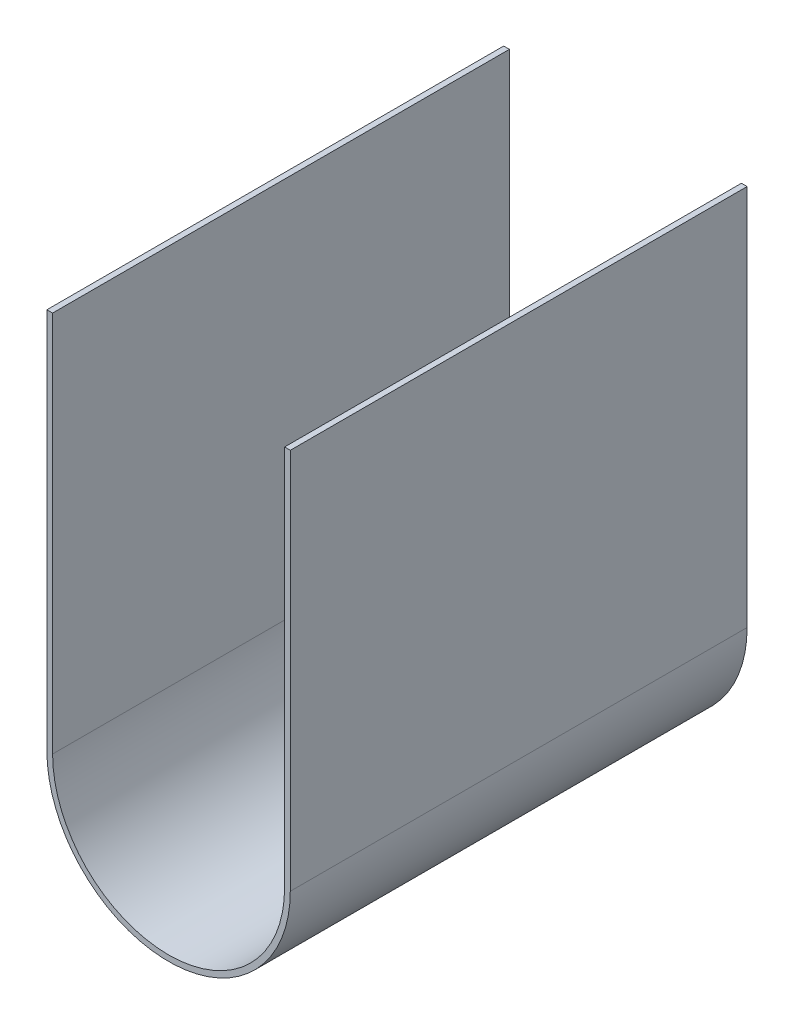
ISO-10303-21;
HEADER;
FILE_DESCRIPTION(('STEP AP214'),'2;1');
FILE_NAME('part.step','',(''),(''),'','','');
FILE_SCHEMA(('AUTOMOTIVE_DESIGN { 1 0 10303 214 1 1 1 1 }'));
ENDSEC;
DATA;
#1=APPLICATION_CONTEXT('core data for automotive mechanical design processes');
#2=APPLICATION_PROTOCOL_DEFINITION('international standard','automotive_design',2000,#1);
#3=PRODUCT_CONTEXT('',#1,'mechanical');
#4=PRODUCT('Part','Part','',(#3));
#5=PRODUCT_RELATED_PRODUCT_CATEGORY('part','',(#4));
#6=PRODUCT_DEFINITION_FORMATION('','',#4);
#7=PRODUCT_DEFINITION_CONTEXT('part definition',#1,'design');
#8=PRODUCT_DEFINITION('design','',#6,#7);
#9=PRODUCT_DEFINITION_SHAPE('','',#8);
#10=(LENGTH_UNIT() NAMED_UNIT(*) SI_UNIT(.MILLI.,.METRE.));
#11=(NAMED_UNIT(*) PLANE_ANGLE_UNIT() SI_UNIT($,.RADIAN.));
#12=(NAMED_UNIT(*) SI_UNIT($,.STERADIAN.) SOLID_ANGLE_UNIT());
#13=UNCERTAINTY_MEASURE_WITH_UNIT(LENGTH_MEASURE(1.E-05),#10,'distance_accuracy_value','');
#14=(GEOMETRIC_REPRESENTATION_CONTEXT(3) GLOBAL_UNCERTAINTY_ASSIGNED_CONTEXT((#13)) GLOBAL_UNIT_ASSIGNED_CONTEXT((#10,
#11,#12)) REPRESENTATION_CONTEXT('',''));
#15=CARTESIAN_POINT('',(0.,0.,0.));
#16=DIRECTION('',(0.,0.,1.));
#17=DIRECTION('',(1.,0.,0.));
#18=AXIS2_PLACEMENT_3D('',#15,#16,#17);
#19=CARTESIAN_POINT('',(34.1,0.,128.));
#20=DIRECTION('',(1.,0.,0.));
#21=DIRECTION('',(0.,1.,0.));
#22=AXIS2_PLACEMENT_3D('',#19,#20,#21);
#23=PLANE('',#22);
#24=DIRECTION('',(0.,0.,-1.));
#25=VECTOR('',#24,1.);
#26=CARTESIAN_POINT('',(34.1,12.,128.));
#27=LINE('',#26,#25);
#28=CARTESIAN_POINT('',(34.1,12.,128.));
#29=VERTEX_POINT('',#28);
#30=CARTESIAN_POINT('',(34.1,12.,0.));
#31=VERTEX_POINT('',#30);
#32=EDGE_CURVE('E64',#29,#31,#27,.T.);
#33=ORIENTED_EDGE('',*,*,#32,.F.);
#34=DIRECTION('',(0.,-1.,0.));
#35=VECTOR('',#34,1.);
#36=CARTESIAN_POINT('',(34.1,0.,128.));
#37=LINE('',#36,#35);
#38=CARTESIAN_POINT('',(34.1,-95.,128.));
#39=VERTEX_POINT('',#38);
#40=EDGE_CURVE('E132',#29,#39,#37,.T.);
#41=ORIENTED_EDGE('',*,*,#40,.T.);
#42=DIRECTION('',(0.,0.,-1.));
#43=VECTOR('',#42,1.);
#44=CARTESIAN_POINT('',(34.1,-95.,128.));
#45=LINE('',#44,#43);
#46=CARTESIAN_POINT('',(34.1,-95.,0.));
#47=VERTEX_POINT('',#46);
#48=EDGE_CURVE('E139',#39,#47,#45,.T.);
#49=ORIENTED_EDGE('',*,*,#48,.T.);
#50=DIRECTION('',(0.,-1.,0.));
#51=VECTOR('',#50,1.);
#52=CARTESIAN_POINT('',(34.1,0.,0.));
#53=LINE('',#52,#51);
#54=EDGE_CURVE('E140',#31,#47,#53,.T.);
#55=ORIENTED_EDGE('',*,*,#54,.F.);
#56=EDGE_LOOP('',(#33,#41,#49,#55));
#57=FACE_BOUND('',#56,.T.);
#58=ADVANCED_FACE('F43',(#57),#23,.T.);
#59=CARTESIAN_POINT('',(32.5,0.,128.));
#60=DIRECTION('',(1.,0.,0.));
#61=DIRECTION('',(0.,0.,-1.));
#62=AXIS2_PLACEMENT_3D('',#59,#60,#61);
#63=PLANE('',#62);
#64=DIRECTION('',(0.,-1.,0.));
#65=VECTOR('',#64,1.);
#66=CARTESIAN_POINT('',(32.5,0.,128.));
#67=LINE('',#66,#65);
#68=CARTESIAN_POINT('',(32.5,12.,128.));
#69=VERTEX_POINT('',#68);
#70=CARTESIAN_POINT('',(32.5,-95.,128.));
#71=VERTEX_POINT('',#70);
#72=EDGE_CURVE('E137',#69,#71,#67,.T.);
#73=ORIENTED_EDGE('',*,*,#72,.F.);
#74=DIRECTION('',(0.,0.,-1.));
#75=VECTOR('',#74,1.);
#76=CARTESIAN_POINT('',(32.5,12.,128.));
#77=LINE('',#76,#75);
#78=CARTESIAN_POINT('',(32.5,12.,0.));
#79=VERTEX_POINT('',#78);
#80=EDGE_CURVE('E143',#69,#79,#77,.T.);
#81=ORIENTED_EDGE('',*,*,#80,.T.);
#82=DIRECTION('',(0.,-1.,0.));
#83=VECTOR('',#82,1.);
#84=CARTESIAN_POINT('',(32.5,0.,0.));
#85=LINE('',#84,#83);
#86=CARTESIAN_POINT('',(32.5,-95.,0.));
#87=VERTEX_POINT('',#86);
#88=EDGE_CURVE('E153',#79,#87,#85,.T.);
#89=ORIENTED_EDGE('',*,*,#88,.T.);
#90=DIRECTION('',(0.,0.,-1.));
#91=VECTOR('',#90,1.);
#92=CARTESIAN_POINT('',(32.5,-95.,128.));
#93=LINE('',#92,#91);
#94=EDGE_CURVE('E50',#71,#87,#93,.T.);
#95=ORIENTED_EDGE('',*,*,#94,.F.);
#96=EDGE_LOOP('',(#73,#81,#89,#95));
#97=FACE_BOUND('',#96,.T.);
#98=ADVANCED_FACE('F176',(#97),#63,.F.);
#99=CARTESIAN_POINT('',(0.,-95.,128.));
#100=DIRECTION('',(0.,0.,-1.));
#101=DIRECTION('',(-1.,0.,0.));
#102=AXIS2_PLACEMENT_3D('',#99,#100,#101);
#103=CYLINDRICAL_SURFACE('',#102,32.5);
#104=CARTESIAN_POINT('',(0.,-95.,0.));
#105=DIRECTION('',(0.,0.,-1.));
#106=DIRECTION('',(-1.,0.,0.));
#107=AXIS2_PLACEMENT_3D('',#104,#105,#106);
#108=CIRCLE('',#107,32.5);
#109=CARTESIAN_POINT('',(-32.5,-95.,0.));
#110=VERTEX_POINT('',#109);
#111=EDGE_CURVE('E151',#87,#110,#108,.T.);
#112=ORIENTED_EDGE('',*,*,#111,.T.);
#113=DIRECTION('',(0.,0.,-1.));
#114=VECTOR('',#113,1.);
#115=CARTESIAN_POINT('',(-32.5,-95.,128.));
#116=LINE('',#115,#114);
#117=CARTESIAN_POINT('',(-32.5,-95.,128.));
#118=VERTEX_POINT('',#117);
#119=EDGE_CURVE('E157',#118,#110,#116,.T.);
#120=ORIENTED_EDGE('',*,*,#119,.F.);
#121=CARTESIAN_POINT('',(0.,-95.,128.));
#122=DIRECTION('',(0.,0.,-1.));
#123=DIRECTION('',(-1.,0.,0.));
#124=AXIS2_PLACEMENT_3D('',#121,#122,#123);
#125=CIRCLE('',#124,32.5);
#126=EDGE_CURVE('E130',#71,#118,#125,.T.);
#127=ORIENTED_EDGE('',*,*,#126,.F.);
#128=ORIENTED_EDGE('',*,*,#94,.T.);
#129=EDGE_LOOP('',(#112,#120,#127,#128));
#130=FACE_BOUND('',#129,.T.);
#131=ADVANCED_FACE('F188',(#130),#103,.F.);
#132=CARTESIAN_POINT('',(-32.5,0.,128.));
#133=DIRECTION('',(-1.,0.,0.));
#134=DIRECTION('',(0.,0.,1.));
#135=AXIS2_PLACEMENT_3D('',#132,#133,#134);
#136=PLANE('',#135);
#137=DIRECTION('',(0.,1.,0.));
#138=VECTOR('',#137,1.);
#139=CARTESIAN_POINT('',(-32.5,0.,0.));
#140=LINE('',#139,#138);
#141=CARTESIAN_POINT('',(-32.5,12.,0.));
#142=VERTEX_POINT('',#141);
#143=EDGE_CURVE('E148',#110,#142,#140,.T.);
#144=ORIENTED_EDGE('',*,*,#143,.T.);
#145=DIRECTION('',(0.,0.,1.));
#146=VECTOR('',#145,1.);
#147=CARTESIAN_POINT('',(-32.5,12.,128.));
#148=LINE('',#147,#146);
#149=CARTESIAN_POINT('',(-32.5,12.,128.));
#150=VERTEX_POINT('',#149);
#151=EDGE_CURVE('E57',#142,#150,#148,.T.);
#152=ORIENTED_EDGE('',*,*,#151,.T.);
#153=DIRECTION('',(0.,1.,0.));
#154=VECTOR('',#153,1.);
#155=CARTESIAN_POINT('',(-32.5,0.,128.));
#156=LINE('',#155,#154);
#157=EDGE_CURVE('E124',#118,#150,#156,.T.);
#158=ORIENTED_EDGE('',*,*,#157,.F.);
#159=ORIENTED_EDGE('',*,*,#119,.T.);
#160=EDGE_LOOP('',(#144,#152,#158,#159));
#161=FACE_BOUND('',#160,.T.);
#162=ADVANCED_FACE('F184',(#161),#136,.F.);
#163=CARTESIAN_POINT('',(-34.1,0.,128.));
#164=DIRECTION('',(-1.,0.,0.));
#165=DIRECTION('',(0.,0.,1.));
#166=AXIS2_PLACEMENT_3D('',#163,#164,#165);
#167=PLANE('',#166);
#168=DIRECTION('',(0.,0.,-1.));
#169=VECTOR('',#168,1.);
#170=CARTESIAN_POINT('',(-34.1,12.,128.));
#171=LINE('',#170,#169);
#172=CARTESIAN_POINT('',(-34.1,12.,128.));
#173=VERTEX_POINT('',#172);
#174=CARTESIAN_POINT('',(-34.1,12.,0.));
#175=VERTEX_POINT('',#174);
#176=EDGE_CURVE('E104',#173,#175,#171,.T.);
#177=ORIENTED_EDGE('',*,*,#176,.T.);
#178=DIRECTION('',(0.,1.,0.));
#179=VECTOR('',#178,1.);
#180=CARTESIAN_POINT('',(-34.1,0.,0.));
#181=LINE('',#180,#179);
#182=CARTESIAN_POINT('',(-34.1,-95.,0.));
#183=VERTEX_POINT('',#182);
#184=EDGE_CURVE('E146',#183,#175,#181,.T.);
#185=ORIENTED_EDGE('',*,*,#184,.F.);
#186=DIRECTION('',(0.,0.,-1.));
#187=VECTOR('',#186,1.);
#188=CARTESIAN_POINT('',(-34.1,-95.,128.));
#189=LINE('',#188,#187);
#190=CARTESIAN_POINT('',(-34.1,-95.,128.));
#191=VERTEX_POINT('',#190);
#192=EDGE_CURVE('E127',#191,#183,#189,.T.);
#193=ORIENTED_EDGE('',*,*,#192,.F.);
#194=DIRECTION('',(0.,1.,0.));
#195=VECTOR('',#194,1.);
#196=CARTESIAN_POINT('',(-34.1,0.,128.));
#197=LINE('',#196,#195);
#198=EDGE_CURVE('E121',#191,#173,#197,.T.);
#199=ORIENTED_EDGE('',*,*,#198,.T.);
#200=EDGE_LOOP('',(#177,#185,#193,#199));
#201=FACE_BOUND('',#200,.T.);
#202=ADVANCED_FACE('F126',(#201),#167,.T.);
#203=CARTESIAN_POINT('',(0.,-95.,128.));
#204=DIRECTION('',(0.,0.,-1.));
#205=DIRECTION('',(-1.,0.,0.));
#206=AXIS2_PLACEMENT_3D('',#203,#204,#205);
#207=CYLINDRICAL_SURFACE('',#206,34.1);
#208=CARTESIAN_POINT('',(0.,-95.,0.));
#209=DIRECTION('',(0.,0.,-1.));
#210=DIRECTION('',(-1.,0.,0.));
#211=AXIS2_PLACEMENT_3D('',#208,#209,#210);
#212=CIRCLE('',#211,34.1);
#213=EDGE_CURVE('E142',#47,#183,#212,.T.);
#214=ORIENTED_EDGE('',*,*,#213,.F.);
#215=ORIENTED_EDGE('',*,*,#48,.F.);
#216=CARTESIAN_POINT('',(0.,-95.,128.));
#217=DIRECTION('',(0.,0.,-1.));
#218=DIRECTION('',(-1.,0.,0.));
#219=AXIS2_PLACEMENT_3D('',#216,#217,#218);
#220=CIRCLE('',#219,34.1);
#221=EDGE_CURVE('E128',#39,#191,#220,.T.);
#222=ORIENTED_EDGE('',*,*,#221,.T.);
#223=ORIENTED_EDGE('',*,*,#192,.T.);
#224=EDGE_LOOP('',(#214,#215,#222,#223));
#225=FACE_BOUND('',#224,.T.);
#226=ADVANCED_FACE('F166',(#225),#207,.T.);
#227=CARTESIAN_POINT('',(0.,0.,128.));
#228=DIRECTION('',(0.,0.,-1.));
#229=DIRECTION('',(-1.,0.,0.));
#230=AXIS2_PLACEMENT_3D('',#227,#228,#229);
#231=PLANE('',#230);
#232=ORIENTED_EDGE('',*,*,#40,.F.);
#233=DIRECTION('',(1.,0.,0.));
#234=VECTOR('',#233,1.);
#235=CARTESIAN_POINT('',(-34.1,12.,128.));
#236=LINE('',#235,#234);
#237=EDGE_CURVE('E113',#69,#29,#236,.T.);
#238=ORIENTED_EDGE('',*,*,#237,.F.);
#239=ORIENTED_EDGE('',*,*,#72,.T.);
#240=ORIENTED_EDGE('',*,*,#126,.T.);
#241=ORIENTED_EDGE('',*,*,#157,.T.);
#242=EDGE_CURVE('E107',#173,#150,#236,.T.);
#243=ORIENTED_EDGE('',*,*,#242,.F.);
#244=ORIENTED_EDGE('',*,*,#198,.F.);
#245=ORIENTED_EDGE('',*,*,#221,.F.);
#246=EDGE_LOOP('',(#232,#238,#239,#240,#241,#243,#244,#245));
#247=FACE_BOUND('',#246,.T.);
#248=ADVANCED_FACE('F119',(#247),#231,.F.);
#249=CARTESIAN_POINT('',(0.,0.,0.));
#250=DIRECTION('',(0.,0.,-1.));
#251=DIRECTION('',(-1.,0.,0.));
#252=AXIS2_PLACEMENT_3D('',#249,#250,#251);
#253=PLANE('',#252);
#254=DIRECTION('',(-1.,0.,0.));
#255=VECTOR('',#254,1.);
#256=CARTESIAN_POINT('',(0.,12.,0.));
#257=LINE('',#256,#255);
#258=EDGE_CURVE('E11',#31,#79,#257,.T.);
#259=ORIENTED_EDGE('',*,*,#258,.F.);
#260=ORIENTED_EDGE('',*,*,#54,.T.);
#261=ORIENTED_EDGE('',*,*,#213,.T.);
#262=ORIENTED_EDGE('',*,*,#184,.T.);
#263=DIRECTION('',(1.,0.,0.));
#264=VECTOR('',#263,1.);
#265=CARTESIAN_POINT('',(-34.1,12.,0.));
#266=LINE('',#265,#264);
#267=EDGE_CURVE('E108',#175,#142,#266,.T.);
#268=ORIENTED_EDGE('',*,*,#267,.T.);
#269=ORIENTED_EDGE('',*,*,#143,.F.);
#270=ORIENTED_EDGE('',*,*,#111,.F.);
#271=ORIENTED_EDGE('',*,*,#88,.F.);
#272=EDGE_LOOP('',(#259,#260,#261,#262,#268,#269,#270,#271));
#273=FACE_BOUND('',#272,.T.);
#274=ADVANCED_FACE('F168',(#273),#253,.T.);
#275=CARTESIAN_POINT('',(-34.1,12.,128.));
#276=DIRECTION('',(0.,-1.,0.));
#277=DIRECTION('',(1.,0.,0.));
#278=AXIS2_PLACEMENT_3D('',#275,#276,#277);
#279=PLANE('',#278);
#280=ORIENTED_EDGE('',*,*,#267,.F.);
#281=ORIENTED_EDGE('',*,*,#176,.F.);
#282=ORIENTED_EDGE('',*,*,#242,.T.);
#283=ORIENTED_EDGE('',*,*,#151,.F.);
#284=EDGE_LOOP('',(#280,#281,#282,#283));
#285=FACE_BOUND('',#284,.T.);
#286=ADVANCED_FACE('F106',(#285),#279,.F.);
#287=ORIENTED_EDGE('',*,*,#237,.T.);
#288=ORIENTED_EDGE('',*,*,#32,.T.);
#289=ORIENTED_EDGE('',*,*,#258,.T.);
#290=ORIENTED_EDGE('',*,*,#80,.F.);
#291=EDGE_LOOP('',(#287,#288,#289,#290));
#292=FACE_BOUND('',#291,.T.);
#293=ADVANCED_FACE('F172',(#292),#279,.F.);
#294=CLOSED_SHELL('',(#58,#98,#131,#162,#202,#226,#248,#274,#286,#293));
#295=MANIFOLD_SOLID_BREP('B2',#294);
#296=ADVANCED_BREP_SHAPE_REPRESENTATION('',(#18,#295),#14);
#297=SHAPE_DEFINITION_REPRESENTATION(#9,#296);
ENDSEC;
END-ISO-10303-21;
